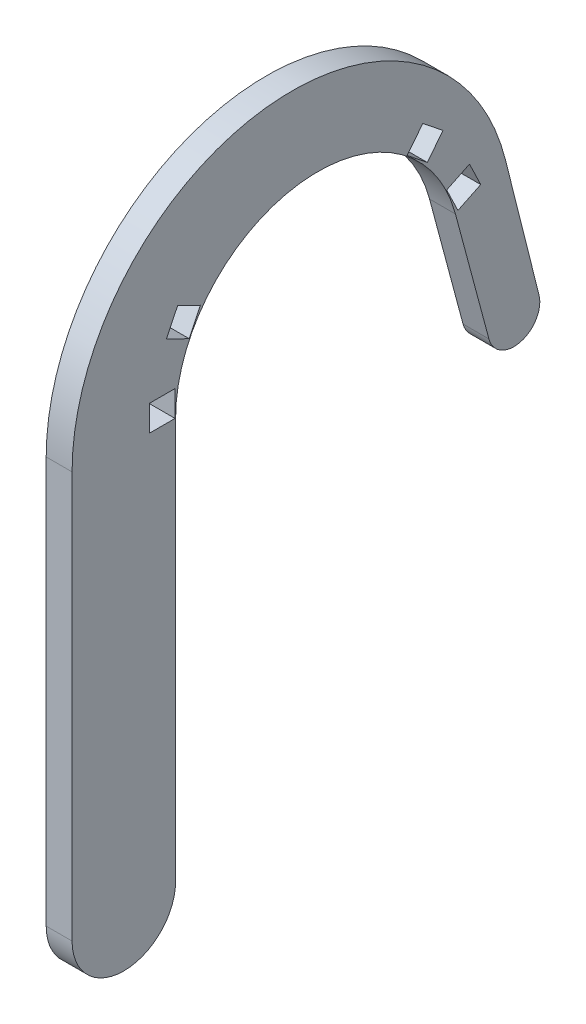
ISO-10303-21;
HEADER;
FILE_DESCRIPTION(('STEP AP214'),'2;1');
FILE_NAME('part.step','',(''),(''),'','','');
FILE_SCHEMA(('AUTOMOTIVE_DESIGN { 1 0 10303 214 1 1 1 1 }'));
ENDSEC;
DATA;
#1=APPLICATION_CONTEXT('core data for automotive mechanical design processes');
#2=APPLICATION_PROTOCOL_DEFINITION('international standard','automotive_design',2000,#1);
#3=PRODUCT_CONTEXT('',#1,'mechanical');
#4=PRODUCT('Part','Part','',(#3));
#5=PRODUCT_RELATED_PRODUCT_CATEGORY('part','',(#4));
#6=PRODUCT_DEFINITION_FORMATION('','',#4);
#7=PRODUCT_DEFINITION_CONTEXT('part definition',#1,'design');
#8=PRODUCT_DEFINITION('design','',#6,#7);
#9=PRODUCT_DEFINITION_SHAPE('','',#8);
#10=(LENGTH_UNIT() NAMED_UNIT(*) SI_UNIT(.MILLI.,.METRE.));
#11=(NAMED_UNIT(*) PLANE_ANGLE_UNIT() SI_UNIT($,.RADIAN.));
#12=(NAMED_UNIT(*) SI_UNIT($,.STERADIAN.) SOLID_ANGLE_UNIT());
#13=UNCERTAINTY_MEASURE_WITH_UNIT(LENGTH_MEASURE(1.E-05),#10,'distance_accuracy_value','');
#14=(GEOMETRIC_REPRESENTATION_CONTEXT(3) GLOBAL_UNCERTAINTY_ASSIGNED_CONTEXT((#13)) GLOBAL_UNIT_ASSIGNED_CONTEXT((#10,
#11,#12)) REPRESENTATION_CONTEXT('',''));
#15=CARTESIAN_POINT('',(0.,0.,0.));
#16=DIRECTION('',(0.,0.,1.));
#17=DIRECTION('',(1.,0.,0.));
#18=AXIS2_PLACEMENT_3D('',#15,#16,#17);
#19=CARTESIAN_POINT('',(6.35,-98.425,47.625));
#20=DIRECTION('',(-1.,0.,0.));
#21=DIRECTION('',(0.,0.,1.));
#22=AXIS2_PLACEMENT_3D('',#19,#20,#21);
#23=CYLINDRICAL_SURFACE('',#22,12.7);
#24=CARTESIAN_POINT('',(0.,-98.425,47.625));
#25=DIRECTION('',(1.,0.,0.));
#26=DIRECTION('',(0.,0.,1.));
#27=AXIS2_PLACEMENT_3D('',#24,#25,#26);
#28=CIRCLE('',#27,12.7);
#29=CARTESIAN_POINT('',(0.,-98.425,60.325));
#30=VERTEX_POINT('',#29);
#31=CARTESIAN_POINT('',(0.,-98.425,34.925));
#32=VERTEX_POINT('',#31);
#33=EDGE_CURVE('E338',#30,#32,#28,.T.);
#34=ORIENTED_EDGE('',*,*,#33,.T.);
#35=DIRECTION('',(-1.,0.,0.));
#36=VECTOR('',#35,1.);
#37=CARTESIAN_POINT('',(6.35,-98.425,34.925));
#38=LINE('',#37,#36);
#39=CARTESIAN_POINT('',(6.35,-98.425,34.925));
#40=VERTEX_POINT('',#39);
#41=EDGE_CURVE('E11',#40,#32,#38,.T.);
#42=ORIENTED_EDGE('',*,*,#41,.F.);
#43=CARTESIAN_POINT('',(6.35,-98.425,47.625));
#44=DIRECTION('',(1.,0.,0.));
#45=DIRECTION('',(0.,0.,1.));
#46=AXIS2_PLACEMENT_3D('',#43,#44,#45);
#47=CIRCLE('',#46,12.7);
#48=CARTESIAN_POINT('',(6.35,-98.425,60.325));
#49=VERTEX_POINT('',#48);
#50=EDGE_CURVE('E339',#49,#40,#47,.T.);
#51=ORIENTED_EDGE('',*,*,#50,.F.);
#52=DIRECTION('',(-1.,0.,0.));
#53=VECTOR('',#52,1.);
#54=CARTESIAN_POINT('',(6.35,-98.425,60.325));
#55=LINE('',#54,#53);
#56=EDGE_CURVE('E357',#49,#30,#55,.T.);
#57=ORIENTED_EDGE('',*,*,#56,.T.);
#58=EDGE_LOOP('',(#34,#42,#51,#57));
#59=FACE_BOUND('',#58,.T.);
#60=ADVANCED_FACE('F33',(#59),#23,.T.);
#61=CARTESIAN_POINT('',(6.35,0.,34.925));
#62=DIRECTION('',(0.,0.,1.));
#63=DIRECTION('',(0.,-1.,0.));
#64=AXIS2_PLACEMENT_3D('',#61,#62,#63);
#65=PLANE('',#64);
#66=DIRECTION('',(0.,1.,0.));
#67=VECTOR('',#66,1.);
#68=CARTESIAN_POINT('',(0.,0.,34.925));
#69=LINE('',#68,#67);
#70=CARTESIAN_POINT('',(0.,0.,34.925));
#71=VERTEX_POINT('',#70);
#72=EDGE_CURVE('E360',#32,#71,#69,.T.);
#73=ORIENTED_EDGE('',*,*,#72,.T.);
#74=DIRECTION('',(-1.,0.,0.));
#75=VECTOR('',#74,1.);
#76=CARTESIAN_POINT('',(6.35,0.,34.925));
#77=LINE('',#76,#75);
#78=CARTESIAN_POINT('',(6.35,0.,34.925));
#79=VERTEX_POINT('',#78);
#80=EDGE_CURVE('E40',#79,#71,#77,.T.);
#81=ORIENTED_EDGE('',*,*,#80,.F.);
#82=DIRECTION('',(0.,1.,0.));
#83=VECTOR('',#82,1.);
#84=CARTESIAN_POINT('',(6.35,0.,34.925));
#85=LINE('',#84,#83);
#86=EDGE_CURVE('E342',#40,#79,#85,.T.);
#87=ORIENTED_EDGE('',*,*,#86,.F.);
#88=ORIENTED_EDGE('',*,*,#41,.T.);
#89=EDGE_LOOP('',(#73,#81,#87,#88));
#90=FACE_BOUND('',#89,.T.);
#91=ADVANCED_FACE('F416',(#90),#65,.F.);
#92=CARTESIAN_POINT('',(6.35,0.,0.));
#93=DIRECTION('',(-1.,0.,0.));
#94=DIRECTION('',(0.,0.,1.));
#95=AXIS2_PLACEMENT_3D('',#92,#93,#94);
#96=CYLINDRICAL_SURFACE('',#95,34.925);
#97=CARTESIAN_POINT('',(0.,0.,0.));
#98=DIRECTION('',(-1.,0.,0.));
#99=DIRECTION('',(0.,0.,-1.));
#100=AXIS2_PLACEMENT_3D('',#97,#98,#99);
#101=CIRCLE('',#100,34.925);
#102=CARTESIAN_POINT('',(0.,9.03925515020532,-33.7349594831458));
#103=VERTEX_POINT('',#102);
#104=EDGE_CURVE('E362',#71,#103,#101,.T.);
#105=ORIENTED_EDGE('',*,*,#104,.T.);
#106=DIRECTION('',(-1.,0.,0.));
#107=VECTOR('',#106,1.);
#108=CARTESIAN_POINT('',(6.35,9.03925515020532,-33.7349594831458));
#109=LINE('',#108,#107);
#110=CARTESIAN_POINT('',(6.35,9.03925515020532,-33.7349594831458));
#111=VERTEX_POINT('',#110);
#112=EDGE_CURVE('E387',#111,#103,#109,.T.);
#113=ORIENTED_EDGE('',*,*,#112,.F.);
#114=CARTESIAN_POINT('',(6.35,0.,0.));
#115=DIRECTION('',(-1.,0.,0.));
#116=DIRECTION('',(0.,0.,-1.));
#117=AXIS2_PLACEMENT_3D('',#114,#115,#116);
#118=CIRCLE('',#117,34.925);
#119=EDGE_CURVE('E345',#79,#111,#118,.T.);
#120=ORIENTED_EDGE('',*,*,#119,.F.);
#121=ORIENTED_EDGE('',*,*,#80,.T.);
#122=EDGE_LOOP('',(#105,#113,#120,#121));
#123=FACE_BOUND('',#122,.T.);
#124=ADVANCED_FACE('F394',(#123),#96,.F.);
#125=CARTESIAN_POINT('',(6.35,-21.6288898344726,-41.9524641651506));
#126=DIRECTION('',(0.,0.258819045102515,-0.96592582628907));
#127=DIRECTION('',(0.,0.96592582628907,0.258819045102515));
#128=AXIS2_PLACEMENT_3D('',#125,#126,#127);
#129=PLANE('',#128);
#130=DIRECTION('',(0.,-0.96592582628907,-0.258819045102515));
#131=VECTOR('',#130,1.);
#132=CARTESIAN_POINT('',(0.,-21.6288898344726,-41.9524641651506));
#133=LINE('',#132,#131);
#134=CARTESIAN_POINT('',(0.,-21.6288898344726,-41.9524641651506));
#135=VERTEX_POINT('',#134);
#136=EDGE_CURVE('E364',#103,#135,#133,.T.);
#137=ORIENTED_EDGE('',*,*,#136,.T.);
#138=DIRECTION('',(-1.,0.,0.));
#139=VECTOR('',#138,1.);
#140=CARTESIAN_POINT('',(6.35,-21.6288898344726,-41.9524641651506));
#141=LINE('',#140,#139);
#142=CARTESIAN_POINT('',(6.35,-21.6288898344726,-41.9524641651506));
#143=VERTEX_POINT('',#142);
#144=EDGE_CURVE('E384',#143,#135,#141,.T.);
#145=ORIENTED_EDGE('',*,*,#144,.F.);
#146=DIRECTION('',(0.,-0.96592582628907,-0.258819045102515));
#147=VECTOR('',#146,1.);
#148=CARTESIAN_POINT('',(6.35,-21.6288898344726,-41.9524641651506));
#149=LINE('',#148,#147);
#150=EDGE_CURVE('E347',#111,#143,#149,.T.);
#151=ORIENTED_EDGE('',*,*,#150,.F.);
#152=ORIENTED_EDGE('',*,*,#112,.T.);
#153=EDGE_LOOP('',(#137,#145,#151,#152));
#154=FACE_BOUND('',#153,.T.);
#155=ADVANCED_FACE('F404',(#154),#129,.F.);
#156=CARTESIAN_POINT('',(6.35,-19.9853888980717,-48.0860931620862));
#157=DIRECTION('',(-1.,0.,0.));
#158=DIRECTION('',(0.,0.,1.));
#159=AXIS2_PLACEMENT_3D('',#156,#157,#158);
#160=CYLINDRICAL_SURFACE('',#159,6.35);
#161=CARTESIAN_POINT('',(0.,-19.9853888980717,-48.0860931620862));
#162=DIRECTION('',(1.,0.,0.));
#163=DIRECTION('',(0.,0.,-1.));
#164=AXIS2_PLACEMENT_3D('',#161,#162,#163);
#165=CIRCLE('',#164,6.35);
#166=CARTESIAN_POINT('',(0.,-18.4397224636465,-54.2451040626685));
#167=VERTEX_POINT('',#166);
#168=EDGE_CURVE('E366',#135,#167,#165,.T.);
#169=ORIENTED_EDGE('',*,*,#168,.T.);
#170=DIRECTION('',(-1.,0.,0.));
#171=VECTOR('',#170,1.);
#172=CARTESIAN_POINT('',(6.35,-18.4397224636465,-54.2451040626685));
#173=LINE('',#172,#171);
#174=CARTESIAN_POINT('',(6.35,-18.4397224636465,-54.2451040626685));
#175=VERTEX_POINT('',#174);
#176=EDGE_CURVE('E381',#175,#167,#173,.T.);
#177=ORIENTED_EDGE('',*,*,#176,.F.);
#178=CARTESIAN_POINT('',(6.35,-19.9853888980717,-48.0860931620862));
#179=DIRECTION('',(1.,0.,0.));
#180=DIRECTION('',(0.,0.,-1.));
#181=AXIS2_PLACEMENT_3D('',#178,#179,#180);
#182=CIRCLE('',#181,6.35);
#183=EDGE_CURVE('E349',#143,#175,#182,.T.);
#184=ORIENTED_EDGE('',*,*,#183,.F.);
#185=ORIENTED_EDGE('',*,*,#144,.T.);
#186=EDGE_LOOP('',(#169,#177,#184,#185));
#187=FACE_BOUND('',#186,.T.);
#188=ADVANCED_FACE('F408',(#187),#160,.T.);
#189=CARTESIAN_POINT('',(6.35,14.4081646926137,-46.0015926549495));
#190=DIRECTION('',(0.,-0.243412036917344,0.969922976469652));
#191=DIRECTION('',(0.,-0.969922976469652,-0.243412036917344));
#192=AXIS2_PLACEMENT_3D('',#189,#190,#191);
#193=PLANE('',#192);
#194=DIRECTION('',(0.,0.969922976469652,0.243412036917344));
#195=VECTOR('',#194,1.);
#196=CARTESIAN_POINT('',(0.,14.4081646926137,-46.0015926549495));
#197=LINE('',#196,#195);
#198=CARTESIAN_POINT('',(0.,14.4081646926137,-46.0015926549495));
#199=VERTEX_POINT('',#198);
#200=EDGE_CURVE('E368',#167,#199,#197,.T.);
#201=ORIENTED_EDGE('',*,*,#200,.T.);
#202=DIRECTION('',(-1.,0.,0.));
#203=VECTOR('',#202,1.);
#204=CARTESIAN_POINT('',(6.35,14.4081646926137,-46.0015926549495));
#205=LINE('',#204,#203);
#206=CARTESIAN_POINT('',(6.35,14.4081646926137,-46.0015926549495));
#207=VERTEX_POINT('',#206);
#208=EDGE_CURVE('E378',#207,#199,#205,.T.);
#209=ORIENTED_EDGE('',*,*,#208,.F.);
#210=DIRECTION('',(0.,0.969922976469652,0.243412036917344));
#211=VECTOR('',#210,1.);
#212=CARTESIAN_POINT('',(6.35,14.4081646926137,-46.0015926549495));
#213=LINE('',#212,#211);
#214=EDGE_CURVE('E351',#175,#207,#213,.T.);
#215=ORIENTED_EDGE('',*,*,#214,.F.);
#216=ORIENTED_EDGE('',*,*,#176,.T.);
#217=EDGE_LOOP('',(#201,#209,#215,#216));
#218=FACE_BOUND('',#217,.T.);
#219=ADVANCED_FACE('F429',(#218),#193,.F.);
#220=CARTESIAN_POINT('',(6.35,1.27,6.35));
#221=DIRECTION('',(-1.,0.,0.));
#222=DIRECTION('',(0.,0.,1.));
#223=AXIS2_PLACEMENT_3D('',#220,#221,#222);
#224=CYLINDRICAL_SURFACE('',#223,53.975);
#225=CARTESIAN_POINT('',(0.,1.27,6.35));
#226=DIRECTION('',(1.,0.,0.));
#227=DIRECTION('',(0.,0.,-1.));
#228=AXIS2_PLACEMENT_3D('',#225,#226,#227);
#229=CIRCLE('',#228,53.975);
#230=CARTESIAN_POINT('',(0.,1.27,60.325));
#231=VERTEX_POINT('',#230);
#232=EDGE_CURVE('E370',#199,#231,#229,.T.);
#233=ORIENTED_EDGE('',*,*,#232,.T.);
#234=DIRECTION('',(-1.,0.,0.));
#235=VECTOR('',#234,1.);
#236=CARTESIAN_POINT('',(6.35,1.27,60.325));
#237=LINE('',#236,#235);
#238=CARTESIAN_POINT('',(6.35,1.27,60.325));
#239=VERTEX_POINT('',#238);
#240=EDGE_CURVE('E375',#239,#231,#237,.T.);
#241=ORIENTED_EDGE('',*,*,#240,.F.);
#242=CARTESIAN_POINT('',(6.35,1.27,6.35));
#243=DIRECTION('',(1.,0.,0.));
#244=DIRECTION('',(0.,0.,-1.));
#245=AXIS2_PLACEMENT_3D('',#242,#243,#244);
#246=CIRCLE('',#245,53.975);
#247=EDGE_CURVE('E353',#207,#239,#246,.T.);
#248=ORIENTED_EDGE('',*,*,#247,.F.);
#249=ORIENTED_EDGE('',*,*,#208,.T.);
#250=EDGE_LOOP('',(#233,#241,#248,#249));
#251=FACE_BOUND('',#250,.T.);
#252=ADVANCED_FACE('F427',(#251),#224,.T.);
#253=CARTESIAN_POINT('',(6.35,-98.425,60.325));
#254=DIRECTION('',(0.,0.,-1.));
#255=DIRECTION('',(0.,1.,0.));
#256=AXIS2_PLACEMENT_3D('',#253,#254,#255);
#257=PLANE('',#256);
#258=DIRECTION('',(0.,-1.,0.));
#259=VECTOR('',#258,1.);
#260=CARTESIAN_POINT('',(0.,-98.425,60.325));
#261=LINE('',#260,#259);
#262=EDGE_CURVE('E343',#231,#30,#261,.T.);
#263=ORIENTED_EDGE('',*,*,#262,.T.);
#264=ORIENTED_EDGE('',*,*,#56,.F.);
#265=DIRECTION('',(0.,-1.,0.));
#266=VECTOR('',#265,1.);
#267=CARTESIAN_POINT('',(6.35,-98.425,60.325));
#268=LINE('',#267,#266);
#269=EDGE_CURVE('E355',#239,#49,#268,.T.);
#270=ORIENTED_EDGE('',*,*,#269,.F.);
#271=ORIENTED_EDGE('',*,*,#240,.T.);
#272=EDGE_LOOP('',(#263,#264,#270,#271));
#273=FACE_BOUND('',#272,.T.);
#274=ADVANCED_FACE('F422',(#273),#257,.F.);
#275=CARTESIAN_POINT('',(6.35,-98.425,47.625));
#276=DIRECTION('',(-1.,0.,0.));
#277=DIRECTION('',(0.,0.,1.));
#278=AXIS2_PLACEMENT_3D('',#275,#276,#277);
#279=PLANE('',#278);
#280=DIRECTION('',(0.,0.433883739117558,0.900968867902419));
#281=VECTOR('',#280,1.);
#282=CARTESIAN_POINT('',(6.35,0.0883540502429059,0.183469075803154));
#283=LINE('',#282,#281);
#284=CARTESIAN_POINT('',(6.35,15.2127202133748,31.5895390231411));
#285=VERTEX_POINT('',#284);
#286=CARTESIAN_POINT('',(6.35,17.9085513320772,37.1874900226723));
#287=VERTEX_POINT('',#286);
#288=EDGE_CURVE('E294',#285,#287,#283,.T.);
#289=ORIENTED_EDGE('',*,*,#288,.T.);
#290=DIRECTION('',(0.,0.900968867902419,-0.433883739117559));
#291=VECTOR('',#290,1.);
#292=CARTESIAN_POINT('',(6.35,-80.6048027181656,84.6290209468692));
#293=LINE('',#292,#291);
#294=CARTESIAN_POINT('',(6.35,23.6297036432576,34.4323282792758));
#295=VERTEX_POINT('',#294);
#296=EDGE_CURVE('E198',#287,#295,#293,.T.);
#297=ORIENTED_EDGE('',*,*,#296,.T.);
#298=DIRECTION('',(0.,-0.433883739117559,-0.900968867902419));
#299=VECTOR('',#298,1.);
#300=CARTESIAN_POINT('',(6.35,5.80950636142323,-2.57169266759338));
#301=LINE('',#300,#299);
#302=CARTESIAN_POINT('',(6.35,20.9338725245551,28.8343772797446));
#303=VERTEX_POINT('',#302);
#304=EDGE_CURVE('E299',#295,#303,#301,.T.);
#305=ORIENTED_EDGE('',*,*,#304,.T.);
#306=DIRECTION('',(0.,-0.900968867902419,0.433883739117559));
#307=VECTOR('',#306,1.);
#308=CARTESIAN_POINT('',(6.35,-83.3006338368681,79.031069947338));
#309=LINE('',#308,#307);
#310=EDGE_CURVE('E296',#303,#285,#309,.T.);
#311=ORIENTED_EDGE('',*,*,#310,.T.);
#312=EDGE_LOOP('',(#289,#297,#305,#311));
#313=FACE_BOUND('',#312,.T.);
#314=DIRECTION('',(0.,0.781831482468028,-0.623489801858737));
#315=VECTOR('',#314,1.);
#316=CARTESIAN_POINT('',(6.35,-83.3787823711545,66.4923601384135));
#317=LINE('',#316,#315);
#318=CARTESIAN_POINT('',(6.35,27.4123746167208,-21.8606392829106));
#319=VERTEX_POINT('',#318);
#320=CARTESIAN_POINT('',(6.35,32.2700944388678,-25.7345415717194));
#321=VERTEX_POINT('',#320);
#322=EDGE_CURVE('E282',#319,#321,#317,.T.);
#323=ORIENTED_EDGE('',*,*,#322,.T.);
#324=DIRECTION('',(0.,-0.623489801858737,-0.781831482468027));
#325=VECTOR('',#324,1.);
#326=CARTESIAN_POINT('',(6.35,17.2238768100222,-44.601901710133));
#327=LINE('',#326,#325);
#328=CARTESIAN_POINT('',(6.35,28.3109341970648,-30.6991714853913));
#329=VERTEX_POINT('',#328);
#330=EDGE_CURVE('E291',#321,#329,#327,.T.);
#331=ORIENTED_EDGE('',*,*,#330,.T.);
#332=DIRECTION('',(0.,-0.781831482468027,0.623489801858737));
#333=VECTOR('',#332,1.);
#334=CARTESIAN_POINT('',(6.35,-87.3379426129574,61.5277302247415));
#335=LINE('',#334,#333);
#336=CARTESIAN_POINT('',(6.35,23.4532143749178,-26.8252691965825));
#337=VERTEX_POINT('',#336);
#338=EDGE_CURVE('E288',#329,#337,#335,.T.);
#339=ORIENTED_EDGE('',*,*,#338,.T.);
#340=DIRECTION('',(0.,0.623489801858737,0.781831482468027));
#341=VECTOR('',#340,1.);
#342=CARTESIAN_POINT('',(6.35,12.3661569878752,-40.7279994213242));
#343=LINE('',#342,#341);
#344=EDGE_CURVE('E285',#337,#319,#343,.T.);
#345=ORIENTED_EDGE('',*,*,#344,.T.);
#346=EDGE_LOOP('',(#323,#331,#339,#345));
#347=FACE_BOUND('',#346,.T.);
#348=DIRECTION('',(0.,0.433883739117554,-0.900968867902421));
#349=VECTOR('',#348,1.);
#350=CARTESIAN_POINT('',(6.35,-37.1463703022965,77.1352327377189));
#351=LINE('',#350,#349);
#352=CARTESIAN_POINT('',(6.35,15.2127202133745,-31.5895390231412));
#353=VERTEX_POINT('',#352);
#354=CARTESIAN_POINT('',(6.35,17.908551332077,-37.1874900226725));
#355=VERTEX_POINT('',#354);
#356=EDGE_CURVE('E225',#353,#355,#351,.T.);
#357=ORIENTED_EDGE('',*,*,#356,.T.);
#358=DIRECTION('',(0.,-0.900968867902422,-0.433883739117553));
#359=VECTOR('',#358,1.);
#360=CARTESIAN_POINT('',(6.35,-43.3700783656266,-66.6977227603913));
#361=LINE('',#360,#359);
#362=CARTESIAN_POINT('',(6.35,12.1873990208966,-39.9426517660689));
#363=VERTEX_POINT('',#362);
#364=EDGE_CURVE('E279',#355,#363,#361,.T.);
#365=ORIENTED_EDGE('',*,*,#364,.T.);
#366=DIRECTION('',(0.,-0.433883739117553,0.900968867902422));
#367=VECTOR('',#366,1.);
#368=CARTESIAN_POINT('',(6.35,-42.8675226134768,74.3800709943224));
#369=LINE('',#368,#367);
#370=CARTESIAN_POINT('',(6.35,9.49156790219415,-34.3447007665376));
#371=VERTEX_POINT('',#370);
#372=EDGE_CURVE('E276',#363,#371,#369,.T.);
#373=ORIENTED_EDGE('',*,*,#372,.T.);
#374=DIRECTION('',(0.,0.900968867902422,0.433883739117553));
#375=VECTOR('',#374,1.);
#376=CARTESIAN_POINT('',(6.35,-46.0659094843291,-61.09977176086));
#377=LINE('',#376,#375);
#378=EDGE_CURVE('E273',#371,#353,#377,.T.);
#379=ORIENTED_EDGE('',*,*,#378,.T.);
#380=EDGE_LOOP('',(#357,#365,#373,#379));
#381=FACE_BOUND('',#380,.T.);
#382=DIRECTION('',(0.,0.,1.));
#383=VECTOR('',#382,1.);
#384=CARTESIAN_POINT('',(6.35,0.,47.6250000000001));
#385=LINE('',#384,#383);
#386=CARTESIAN_POINT('',(6.35,0.,35.061743139567));
#387=VERTEX_POINT('',#386);
#388=CARTESIAN_POINT('',(6.35,0.,41.275));
#389=VERTEX_POINT('',#388);
#390=EDGE_CURVE('E319',#387,#389,#385,.T.);
#391=ORIENTED_EDGE('',*,*,#390,.T.);
#392=DIRECTION('',(0.,1.,0.));
#393=VECTOR('',#392,1.);
#394=CARTESIAN_POINT('',(6.35,-98.425,41.275));
#395=LINE('',#394,#393);
#396=CARTESIAN_POINT('',(6.35,6.35,41.275));
#397=VERTEX_POINT('',#396);
#398=EDGE_CURVE('E335',#389,#397,#395,.T.);
#399=ORIENTED_EDGE('',*,*,#398,.T.);
#400=DIRECTION('',(0.,0.,-1.));
#401=VECTOR('',#400,1.);
#402=CARTESIAN_POINT('',(6.35,6.34999999999999,47.625));
#403=LINE('',#402,#401);
#404=CARTESIAN_POINT('',(6.35,6.35,35.061743139567));
#405=VERTEX_POINT('',#404);
#406=EDGE_CURVE('E332',#397,#405,#403,.T.);
#407=ORIENTED_EDGE('',*,*,#406,.T.);
#408=DIRECTION('',(0.,-1.,0.));
#409=VECTOR('',#408,1.);
#410=CARTESIAN_POINT('',(6.35,-98.425,35.061743139567));
#411=LINE('',#410,#409);
#412=EDGE_CURVE('E329',#405,#387,#411,.T.);
#413=ORIENTED_EDGE('',*,*,#412,.T.);
#414=EDGE_LOOP('',(#391,#399,#407,#413));
#415=FACE_BOUND('',#414,.T.);
#416=ORIENTED_EDGE('',*,*,#50,.T.);
#417=ORIENTED_EDGE('',*,*,#86,.T.);
#418=ORIENTED_EDGE('',*,*,#119,.T.);
#419=ORIENTED_EDGE('',*,*,#150,.T.);
#420=ORIENTED_EDGE('',*,*,#183,.T.);
#421=ORIENTED_EDGE('',*,*,#214,.T.);
#422=ORIENTED_EDGE('',*,*,#247,.T.);
#423=ORIENTED_EDGE('',*,*,#269,.T.);
#424=EDGE_LOOP('',(#416,#417,#418,#419,#420,#421,#422,#423));
#425=FACE_BOUND('',#424,.T.);
#426=ADVANCED_FACE('F412',(#313,#347,#381,#415,#425),#279,.F.);
#427=CARTESIAN_POINT('',(0.,-98.425,47.625));
#428=DIRECTION('',(-1.,0.,0.));
#429=DIRECTION('',(0.,0.,1.));
#430=AXIS2_PLACEMENT_3D('',#427,#428,#429);
#431=PLANE('',#430);
#432=DIRECTION('',(0.,-0.900968867902419,0.433883739117559));
#433=VECTOR('',#432,1.);
#434=CARTESIAN_POINT('',(0.,17.9085513320772,37.1874900226723));
#435=LINE('',#434,#433);
#436=CARTESIAN_POINT('',(0.,23.6297036432576,34.4323282792758));
#437=VERTEX_POINT('',#436);
#438=CARTESIAN_POINT('',(0.,17.9085513320772,37.1874900226723));
#439=VERTEX_POINT('',#438);
#440=EDGE_CURVE('E195',#437,#439,#435,.T.);
#441=ORIENTED_EDGE('',*,*,#440,.T.);
#442=DIRECTION('',(0.,-0.433883739117558,-0.900968867902419));
#443=VECTOR('',#442,1.);
#444=CARTESIAN_POINT('',(0.,15.2127202133748,31.5895390231411));
#445=LINE('',#444,#443);
#446=CARTESIAN_POINT('',(0.,15.2127202133747,31.5895390231411));
#447=VERTEX_POINT('',#446);
#448=EDGE_CURVE('E205',#439,#447,#445,.T.);
#449=ORIENTED_EDGE('',*,*,#448,.T.);
#450=DIRECTION('',(0.,0.900968867902419,-0.433883739117559));
#451=VECTOR('',#450,1.);
#452=CARTESIAN_POINT('',(0.,20.9338725245551,28.8343772797446));
#453=LINE('',#452,#451);
#454=CARTESIAN_POINT('',(0.,20.9338725245551,28.8343772797446));
#455=VERTEX_POINT('',#454);
#456=EDGE_CURVE('E210',#447,#455,#453,.T.);
#457=ORIENTED_EDGE('',*,*,#456,.T.);
#458=DIRECTION('',(0.,0.433883739117559,0.900968867902419));
#459=VECTOR('',#458,1.);
#460=CARTESIAN_POINT('',(0.,22.2521227715594,31.5717521236857));
#461=LINE('',#460,#459);
#462=EDGE_CURVE('E201',#455,#437,#461,.T.);
#463=ORIENTED_EDGE('',*,*,#462,.T.);
#464=EDGE_LOOP('',(#441,#449,#457,#463));
#465=FACE_BOUND('',#464,.T.);
#466=DIRECTION('',(0.,0.623489801858737,0.781831482468027));
#467=VECTOR('',#466,1.);
#468=CARTESIAN_POINT('',(0.,32.2700944388678,-25.7345415717194));
#469=LINE('',#468,#467);
#470=CARTESIAN_POINT('',(0.,28.3109341970648,-30.6991714853913));
#471=VERTEX_POINT('',#470);
#472=CARTESIAN_POINT('',(0.,32.2700944388678,-25.7345415717194));
#473=VERTEX_POINT('',#472);
#474=EDGE_CURVE('E230',#471,#473,#469,.T.);
#475=ORIENTED_EDGE('',*,*,#474,.T.);
#476=DIRECTION('',(0.,-0.781831482468027,0.623489801858736));
#477=VECTOR('',#476,1.);
#478=CARTESIAN_POINT('',(0.,27.4123746167208,-21.8606392829106));
#479=LINE('',#478,#477);
#480=CARTESIAN_POINT('',(0.,27.4123746167208,-21.8606392829106));
#481=VERTEX_POINT('',#480);
#482=EDGE_CURVE('E233',#473,#481,#479,.T.);
#483=ORIENTED_EDGE('',*,*,#482,.T.);
#484=DIRECTION('',(0.,-0.623489801858737,-0.781831482468027));
#485=VECTOR('',#484,1.);
#486=CARTESIAN_POINT('',(0.,23.4532143749178,-26.8252691965825));
#487=LINE('',#486,#485);
#488=CARTESIAN_POINT('',(0.,23.4532143749178,-26.8252691965825));
#489=VERTEX_POINT('',#488);
#490=EDGE_CURVE('E237',#481,#489,#487,.T.);
#491=ORIENTED_EDGE('',*,*,#490,.T.);
#492=DIRECTION('',(0.,0.781831482468027,-0.623489801858737));
#493=VECTOR('',#492,1.);
#494=CARTESIAN_POINT('',(0.,25.8286192402288,-28.7195913644899));
#495=LINE('',#494,#493);
#496=EDGE_CURVE('E240',#489,#471,#495,.T.);
#497=ORIENTED_EDGE('',*,*,#496,.T.);
#498=EDGE_LOOP('',(#475,#483,#491,#497));
#499=FACE_BOUND('',#498,.T.);
#500=DIRECTION('',(0.,0.900968867902422,0.433883739117553));
#501=VECTOR('',#500,1.);
#502=CARTESIAN_POINT('',(0.,17.908551332077,-37.1874900226724));
#503=LINE('',#502,#501);
#504=CARTESIAN_POINT('',(0.,12.1873990208966,-39.9426517660689));
#505=VERTEX_POINT('',#504);
#506=CARTESIAN_POINT('',(0.,17.908551332077,-37.1874900226724));
#507=VERTEX_POINT('',#506);
#508=EDGE_CURVE('E249',#505,#507,#503,.T.);
#509=ORIENTED_EDGE('',*,*,#508,.T.);
#510=DIRECTION('',(0.,-0.433883739117554,0.900968867902421));
#511=VECTOR('',#510,1.);
#512=CARTESIAN_POINT('',(0.,15.2127202133745,-31.5895390231412));
#513=LINE('',#512,#511);
#514=CARTESIAN_POINT('',(0.,15.2127202133745,-31.5895390231412));
#515=VERTEX_POINT('',#514);
#516=EDGE_CURVE('E252',#507,#515,#513,.T.);
#517=ORIENTED_EDGE('',*,*,#516,.T.);
#518=DIRECTION('',(0.,-0.900968867902422,-0.433883739117553));
#519=VECTOR('',#518,1.);
#520=CARTESIAN_POINT('',(0.,9.49156790219415,-34.3447007665376));
#521=LINE('',#520,#519);
#522=CARTESIAN_POINT('',(0.,9.49156790219415,-34.3447007665376));
#523=VERTEX_POINT('',#522);
#524=EDGE_CURVE('E255',#515,#523,#521,.T.);
#525=ORIENTED_EDGE('',*,*,#524,.T.);
#526=DIRECTION('',(0.,0.433883739117553,-0.900968867902422));
#527=VECTOR('',#526,1.);
#528=CARTESIAN_POINT('',(0.,10.8098181491984,-37.0820756104787));
#529=LINE('',#528,#527);
#530=EDGE_CURVE('E258',#523,#505,#529,.T.);
#531=ORIENTED_EDGE('',*,*,#530,.T.);
#532=EDGE_LOOP('',(#509,#517,#525,#531));
#533=FACE_BOUND('',#532,.T.);
#534=DIRECTION('',(0.,-1.,0.));
#535=VECTOR('',#534,1.);
#536=CARTESIAN_POINT('',(0.,0.,41.275));
#537=LINE('',#536,#535);
#538=CARTESIAN_POINT('',(0.,6.35,41.275));
#539=VERTEX_POINT('',#538);
#540=CARTESIAN_POINT('',(0.,0.,41.275));
#541=VERTEX_POINT('',#540);
#542=EDGE_CURVE('E303',#539,#541,#537,.T.);
#543=ORIENTED_EDGE('',*,*,#542,.T.);
#544=DIRECTION('',(0.,0.,-1.));
#545=VECTOR('',#544,1.);
#546=CARTESIAN_POINT('',(0.,0.,35.061743139567));
#547=LINE('',#546,#545);
#548=CARTESIAN_POINT('',(0.,0.,35.061743139567));
#549=VERTEX_POINT('',#548);
#550=EDGE_CURVE('E306',#541,#549,#547,.T.);
#551=ORIENTED_EDGE('',*,*,#550,.T.);
#552=DIRECTION('',(0.,1.,0.));
#553=VECTOR('',#552,1.);
#554=CARTESIAN_POINT('',(0.,6.35,35.061743139567));
#555=LINE('',#554,#553);
#556=CARTESIAN_POINT('',(0.,6.35,35.061743139567));
#557=VERTEX_POINT('',#556);
#558=EDGE_CURVE('E309',#549,#557,#555,.T.);
#559=ORIENTED_EDGE('',*,*,#558,.T.);
#560=DIRECTION('',(0.,0.,1.));
#561=VECTOR('',#560,1.);
#562=CARTESIAN_POINT('',(0.,6.35,38.1));
#563=LINE('',#562,#561);
#564=EDGE_CURVE('E312',#557,#539,#563,.T.);
#565=ORIENTED_EDGE('',*,*,#564,.T.);
#566=EDGE_LOOP('',(#543,#551,#559,#565));
#567=FACE_BOUND('',#566,.T.);
#568=ORIENTED_EDGE('',*,*,#33,.F.);
#569=ORIENTED_EDGE('',*,*,#262,.F.);
#570=ORIENTED_EDGE('',*,*,#232,.F.);
#571=ORIENTED_EDGE('',*,*,#200,.F.);
#572=ORIENTED_EDGE('',*,*,#168,.F.);
#573=ORIENTED_EDGE('',*,*,#136,.F.);
#574=ORIENTED_EDGE('',*,*,#104,.F.);
#575=ORIENTED_EDGE('',*,*,#72,.F.);
#576=EDGE_LOOP('',(#568,#569,#570,#571,#572,#573,#574,#575));
#577=FACE_BOUND('',#576,.T.);
#578=ADVANCED_FACE('F212',(#465,#499,#533,#567,#577),#431,.T.);
#579=CARTESIAN_POINT('',(0.,0.,41.275));
#580=DIRECTION('',(0.,0.,1.));
#581=DIRECTION('',(1.,0.,0.));
#582=AXIS2_PLACEMENT_3D('',#579,#580,#581);
#583=PLANE('',#582);
#584=DIRECTION('',(1.,0.,0.));
#585=VECTOR('',#584,1.);
#586=CARTESIAN_POINT('',(0.,0.,41.275));
#587=LINE('',#586,#585);
#588=EDGE_CURVE('E315',#541,#389,#587,.T.);
#589=ORIENTED_EDGE('',*,*,#588,.F.);
#590=ORIENTED_EDGE('',*,*,#542,.F.);
#591=DIRECTION('',(1.,0.,0.));
#592=VECTOR('',#591,1.);
#593=CARTESIAN_POINT('',(0.,6.35,41.275));
#594=LINE('',#593,#592);
#595=EDGE_CURVE('E316',#539,#397,#594,.T.);
#596=ORIENTED_EDGE('',*,*,#595,.T.);
#597=ORIENTED_EDGE('',*,*,#398,.F.);
#598=EDGE_LOOP('',(#589,#590,#596,#597));
#599=FACE_BOUND('',#598,.T.);
#600=ADVANCED_FACE('F481',(#599),#583,.F.);
#601=CARTESIAN_POINT('',(0.,6.35,38.1));
#602=DIRECTION('',(0.,1.,0.));
#603=DIRECTION('',(0.,0.,1.));
#604=AXIS2_PLACEMENT_3D('',#601,#602,#603);
#605=PLANE('',#604);
#606=ORIENTED_EDGE('',*,*,#595,.F.);
#607=ORIENTED_EDGE('',*,*,#564,.F.);
#608=DIRECTION('',(1.,0.,0.));
#609=VECTOR('',#608,1.);
#610=CARTESIAN_POINT('',(0.,6.35,35.061743139567));
#611=LINE('',#610,#609);
#612=EDGE_CURVE('E320',#557,#405,#611,.T.);
#613=ORIENTED_EDGE('',*,*,#612,.T.);
#614=ORIENTED_EDGE('',*,*,#406,.F.);
#615=EDGE_LOOP('',(#606,#607,#613,#614));
#616=FACE_BOUND('',#615,.T.);
#617=ADVANCED_FACE('F486',(#616),#605,.F.);
#618=CARTESIAN_POINT('',(0.,6.35,35.061743139567));
#619=DIRECTION('',(0.,0.,-1.));
#620=DIRECTION('',(-1.,0.,0.));
#621=AXIS2_PLACEMENT_3D('',#618,#619,#620);
#622=PLANE('',#621);
#623=ORIENTED_EDGE('',*,*,#612,.F.);
#624=ORIENTED_EDGE('',*,*,#558,.F.);
#625=DIRECTION('',(1.,0.,0.));
#626=VECTOR('',#625,1.);
#627=CARTESIAN_POINT('',(0.,0.,35.061743139567));
#628=LINE('',#627,#626);
#629=EDGE_CURVE('E323',#549,#387,#628,.T.);
#630=ORIENTED_EDGE('',*,*,#629,.T.);
#631=ORIENTED_EDGE('',*,*,#412,.F.);
#632=EDGE_LOOP('',(#623,#624,#630,#631));
#633=FACE_BOUND('',#632,.T.);
#634=ADVANCED_FACE('F499',(#633),#622,.F.);
#635=CARTESIAN_POINT('',(0.,0.,35.061743139567));
#636=DIRECTION('',(0.,-1.,0.));
#637=DIRECTION('',(0.,0.,-1.));
#638=AXIS2_PLACEMENT_3D('',#635,#636,#637);
#639=PLANE('',#638);
#640=ORIENTED_EDGE('',*,*,#629,.F.);
#641=ORIENTED_EDGE('',*,*,#550,.F.);
#642=ORIENTED_EDGE('',*,*,#588,.T.);
#643=ORIENTED_EDGE('',*,*,#390,.F.);
#644=EDGE_LOOP('',(#640,#641,#642,#643));
#645=FACE_BOUND('',#644,.T.);
#646=ADVANCED_FACE('F509',(#645),#639,.F.);
#647=CARTESIAN_POINT('',(0.,17.908551332077,-37.1874900226724));
#648=DIRECTION('',(0.,0.433883739117553,-0.900968867902422));
#649=DIRECTION('',(0.,0.900968867902422,0.433883739117553));
#650=AXIS2_PLACEMENT_3D('',#647,#648,#649);
#651=PLANE('',#650);
#652=DIRECTION('',(1.,0.,0.));
#653=VECTOR('',#652,1.);
#654=CARTESIAN_POINT('',(0.,17.908551332077,-37.1874900226724));
#655=LINE('',#654,#653);
#656=EDGE_CURVE('E261',#507,#355,#655,.T.);
#657=ORIENTED_EDGE('',*,*,#656,.F.);
#658=ORIENTED_EDGE('',*,*,#508,.F.);
#659=DIRECTION('',(1.,0.,0.));
#660=VECTOR('',#659,1.);
#661=CARTESIAN_POINT('',(0.,12.1873990208966,-39.9426517660689));
#662=LINE('',#661,#660);
#663=EDGE_CURVE('E234',#505,#363,#662,.T.);
#664=ORIENTED_EDGE('',*,*,#663,.T.);
#665=ORIENTED_EDGE('',*,*,#364,.F.);
#666=EDGE_LOOP('',(#657,#658,#664,#665));
#667=FACE_BOUND('',#666,.T.);
#668=ADVANCED_FACE('F519',(#667),#651,.F.);
#669=CARTESIAN_POINT('',(0.,10.8098181491984,-37.0820756104787));
#670=DIRECTION('',(0.,-0.900968867902422,-0.433883739117553));
#671=DIRECTION('',(0.,0.433883739117553,-0.900968867902422));
#672=AXIS2_PLACEMENT_3D('',#669,#670,#671);
#673=PLANE('',#672);
#674=ORIENTED_EDGE('',*,*,#663,.F.);
#675=ORIENTED_EDGE('',*,*,#530,.F.);
#676=DIRECTION('',(1.,0.,0.));
#677=VECTOR('',#676,1.);
#678=CARTESIAN_POINT('',(0.,9.49156790219415,-34.3447007665376));
#679=LINE('',#678,#677);
#680=EDGE_CURVE('E264',#523,#371,#679,.T.);
#681=ORIENTED_EDGE('',*,*,#680,.T.);
#682=ORIENTED_EDGE('',*,*,#372,.F.);
#683=EDGE_LOOP('',(#674,#675,#681,#682));
#684=FACE_BOUND('',#683,.T.);
#685=ADVANCED_FACE('F542',(#684),#673,.F.);
#686=CARTESIAN_POINT('',(0.,9.49156790219415,-34.3447007665376));
#687=DIRECTION('',(0.,-0.433883739117553,0.900968867902422));
#688=DIRECTION('',(0.,-0.900968867902422,-0.433883739117553));
#689=AXIS2_PLACEMENT_3D('',#686,#687,#688);
#690=PLANE('',#689);
#691=ORIENTED_EDGE('',*,*,#680,.F.);
#692=ORIENTED_EDGE('',*,*,#524,.F.);
#693=DIRECTION('',(1.,0.,0.));
#694=VECTOR('',#693,1.);
#695=CARTESIAN_POINT('',(0.,15.2127202133745,-31.5895390231412));
#696=LINE('',#695,#694);
#697=EDGE_CURVE('E267',#515,#353,#696,.T.);
#698=ORIENTED_EDGE('',*,*,#697,.T.);
#699=ORIENTED_EDGE('',*,*,#378,.F.);
#700=EDGE_LOOP('',(#691,#692,#698,#699));
#701=FACE_BOUND('',#700,.T.);
#702=ADVANCED_FACE('F553',(#701),#690,.F.);
#703=CARTESIAN_POINT('',(0.,15.2127202133745,-31.5895390231412));
#704=DIRECTION('',(0.,0.900968867902421,0.433883739117554));
#705=DIRECTION('',(0.,-0.433883739117554,0.900968867902421));
#706=AXIS2_PLACEMENT_3D('',#703,#704,#705);
#707=PLANE('',#706);
#708=ORIENTED_EDGE('',*,*,#697,.F.);
#709=ORIENTED_EDGE('',*,*,#516,.F.);
#710=ORIENTED_EDGE('',*,*,#656,.T.);
#711=ORIENTED_EDGE('',*,*,#356,.F.);
#712=EDGE_LOOP('',(#708,#709,#710,#711));
#713=FACE_BOUND('',#712,.T.);
#714=ADVANCED_FACE('F563',(#713),#707,.F.);
#715=CARTESIAN_POINT('',(0.,32.2700944388678,-25.7345415717194));
#716=DIRECTION('',(0.,0.781831482468027,-0.623489801858737));
#717=DIRECTION('',(0.,0.623489801858737,0.781831482468027));
#718=AXIS2_PLACEMENT_3D('',#715,#716,#717);
#719=PLANE('',#718);
#720=DIRECTION('',(1.,0.,0.));
#721=VECTOR('',#720,1.);
#722=CARTESIAN_POINT('',(0.,32.2700944388678,-25.7345415717194));
#723=LINE('',#722,#721);
#724=EDGE_CURVE('E55',#473,#321,#723,.T.);
#725=ORIENTED_EDGE('',*,*,#724,.F.);
#726=ORIENTED_EDGE('',*,*,#474,.F.);
#727=DIRECTION('',(1.,0.,0.));
#728=VECTOR('',#727,1.);
#729=CARTESIAN_POINT('',(0.,28.3109341970648,-30.6991714853913));
#730=LINE('',#729,#728);
#731=EDGE_CURVE('E215',#471,#329,#730,.T.);
#732=ORIENTED_EDGE('',*,*,#731,.T.);
#733=ORIENTED_EDGE('',*,*,#330,.F.);
#734=EDGE_LOOP('',(#725,#726,#732,#733));
#735=FACE_BOUND('',#734,.T.);
#736=ADVANCED_FACE('F573',(#735),#719,.F.);
#737=CARTESIAN_POINT('',(0.,25.8286192402288,-28.7195913644899));
#738=DIRECTION('',(0.,-0.623489801858737,-0.781831482468027));
#739=DIRECTION('',(0.,0.781831482468027,-0.623489801858737));
#740=AXIS2_PLACEMENT_3D('',#737,#738,#739);
#741=PLANE('',#740);
#742=ORIENTED_EDGE('',*,*,#731,.F.);
#743=ORIENTED_EDGE('',*,*,#496,.F.);
#744=DIRECTION('',(1.,0.,0.));
#745=VECTOR('',#744,1.);
#746=CARTESIAN_POINT('',(0.,23.4532143749178,-26.8252691965825));
#747=LINE('',#746,#745);
#748=EDGE_CURVE('E218',#489,#337,#747,.T.);
#749=ORIENTED_EDGE('',*,*,#748,.T.);
#750=ORIENTED_EDGE('',*,*,#338,.F.);
#751=EDGE_LOOP('',(#742,#743,#749,#750));
#752=FACE_BOUND('',#751,.T.);
#753=ADVANCED_FACE('F583',(#752),#741,.F.);
#754=CARTESIAN_POINT('',(0.,23.4532143749178,-26.8252691965825));
#755=DIRECTION('',(0.,-0.781831482468027,0.623489801858737));
#756=DIRECTION('',(0.,-0.623489801858737,-0.781831482468027));
#757=AXIS2_PLACEMENT_3D('',#754,#755,#756);
#758=PLANE('',#757);
#759=ORIENTED_EDGE('',*,*,#748,.F.);
#760=ORIENTED_EDGE('',*,*,#490,.F.);
#761=DIRECTION('',(1.,0.,0.));
#762=VECTOR('',#761,1.);
#763=CARTESIAN_POINT('',(0.,27.4123746167208,-21.8606392829106));
#764=LINE('',#763,#762);
#765=EDGE_CURVE('E245',#481,#319,#764,.T.);
#766=ORIENTED_EDGE('',*,*,#765,.T.);
#767=ORIENTED_EDGE('',*,*,#344,.F.);
#768=EDGE_LOOP('',(#759,#760,#766,#767));
#769=FACE_BOUND('',#768,.T.);
#770=ADVANCED_FACE('F594',(#769),#758,.F.);
#771=CARTESIAN_POINT('',(0.,27.4123746167208,-21.8606392829106));
#772=DIRECTION('',(0.,0.623489801858736,0.781831482468027));
#773=DIRECTION('',(0.,-0.781831482468028,0.623489801858737));
#774=AXIS2_PLACEMENT_3D('',#771,#772,#773);
#775=PLANE('',#774);
#776=ORIENTED_EDGE('',*,*,#765,.F.);
#777=ORIENTED_EDGE('',*,*,#482,.F.);
#778=ORIENTED_EDGE('',*,*,#724,.T.);
#779=ORIENTED_EDGE('',*,*,#322,.F.);
#780=EDGE_LOOP('',(#776,#777,#778,#779));
#781=FACE_BOUND('',#780,.T.);
#782=ADVANCED_FACE('F604',(#781),#775,.F.);
#783=CARTESIAN_POINT('',(0.,17.9085513320772,37.1874900226723));
#784=DIRECTION('',(0.,0.433883739117559,0.900968867902419));
#785=DIRECTION('',(0.,-0.900968867902419,0.433883739117559));
#786=AXIS2_PLACEMENT_3D('',#783,#784,#785);
#787=PLANE('',#786);
#788=DIRECTION('',(1.,0.,0.));
#789=VECTOR('',#788,1.);
#790=CARTESIAN_POINT('',(0.,17.9085513320772,37.1874900226723));
#791=LINE('',#790,#789);
#792=EDGE_CURVE('E47',#439,#287,#791,.T.);
#793=ORIENTED_EDGE('',*,*,#792,.F.);
#794=ORIENTED_EDGE('',*,*,#440,.F.);
#795=DIRECTION('',(1.,0.,0.));
#796=VECTOR('',#795,1.);
#797=CARTESIAN_POINT('',(0.,23.6297036432576,34.4323282792758));
#798=LINE('',#797,#796);
#799=EDGE_CURVE('E223',#437,#295,#798,.T.);
#800=ORIENTED_EDGE('',*,*,#799,.T.);
#801=ORIENTED_EDGE('',*,*,#296,.F.);
#802=EDGE_LOOP('',(#793,#794,#800,#801));
#803=FACE_BOUND('',#802,.T.);
#804=ADVANCED_FACE('F192',(#803),#787,.F.);
#805=CARTESIAN_POINT('',(0.,22.2521227715594,31.5717521236857));
#806=DIRECTION('',(0.,0.900968867902419,-0.433883739117559));
#807=DIRECTION('',(0.,0.433883739117559,0.900968867902419));
#808=AXIS2_PLACEMENT_3D('',#805,#806,#807);
#809=PLANE('',#808);
#810=ORIENTED_EDGE('',*,*,#799,.F.);
#811=ORIENTED_EDGE('',*,*,#462,.F.);
#812=DIRECTION('',(1.,0.,0.));
#813=VECTOR('',#812,1.);
#814=CARTESIAN_POINT('',(0.,20.9338725245551,28.8343772797446));
#815=LINE('',#814,#813);
#816=EDGE_CURVE('E226',#455,#303,#815,.T.);
#817=ORIENTED_EDGE('',*,*,#816,.T.);
#818=ORIENTED_EDGE('',*,*,#304,.F.);
#819=EDGE_LOOP('',(#810,#811,#817,#818));
#820=FACE_BOUND('',#819,.T.);
#821=ADVANCED_FACE('F622',(#820),#809,.F.);
#822=CARTESIAN_POINT('',(0.,20.9338725245551,28.8343772797446));
#823=DIRECTION('',(0.,-0.433883739117559,-0.900968867902419));
#824=DIRECTION('',(0.,0.900968867902419,-0.433883739117559));
#825=AXIS2_PLACEMENT_3D('',#822,#823,#824);
#826=PLANE('',#825);
#827=ORIENTED_EDGE('',*,*,#816,.F.);
#828=ORIENTED_EDGE('',*,*,#456,.F.);
#829=DIRECTION('',(1.,0.,0.));
#830=VECTOR('',#829,1.);
#831=CARTESIAN_POINT('',(0.,15.2127202133748,31.5895390231411));
#832=LINE('',#831,#830);
#833=EDGE_CURVE('E200',#447,#285,#832,.T.);
#834=ORIENTED_EDGE('',*,*,#833,.T.);
#835=ORIENTED_EDGE('',*,*,#310,.F.);
#836=EDGE_LOOP('',(#827,#828,#834,#835));
#837=FACE_BOUND('',#836,.T.);
#838=ADVANCED_FACE('F632',(#837),#826,.F.);
#839=CARTESIAN_POINT('',(0.,15.2127202133748,31.5895390231411));
#840=DIRECTION('',(0.,-0.900968867902419,0.433883739117558));
#841=DIRECTION('',(0.,-0.433883739117558,-0.900968867902419));
#842=AXIS2_PLACEMENT_3D('',#839,#840,#841);
#843=PLANE('',#842);
#844=ORIENTED_EDGE('',*,*,#833,.F.);
#845=ORIENTED_EDGE('',*,*,#448,.F.);
#846=ORIENTED_EDGE('',*,*,#792,.T.);
#847=ORIENTED_EDGE('',*,*,#288,.F.);
#848=EDGE_LOOP('',(#844,#845,#846,#847));
#849=FACE_BOUND('',#848,.T.);
#850=ADVANCED_FACE('F206',(#849),#843,.F.);
#851=CLOSED_SHELL('',(#60,#91,#124,#155,#188,#219,#252,#274,#426,#578,#600,#617,#634,#646,#668,
#685,#702,#714,#736,#753,#770,#782,#804,#821,#838,#850));
#852=MANIFOLD_SOLID_BREP('B2',#851);
#853=ADVANCED_BREP_SHAPE_REPRESENTATION('',(#18,#852),#14);
#854=SHAPE_DEFINITION_REPRESENTATION(#9,#853);
ENDSEC;
END-ISO-10303-21;
